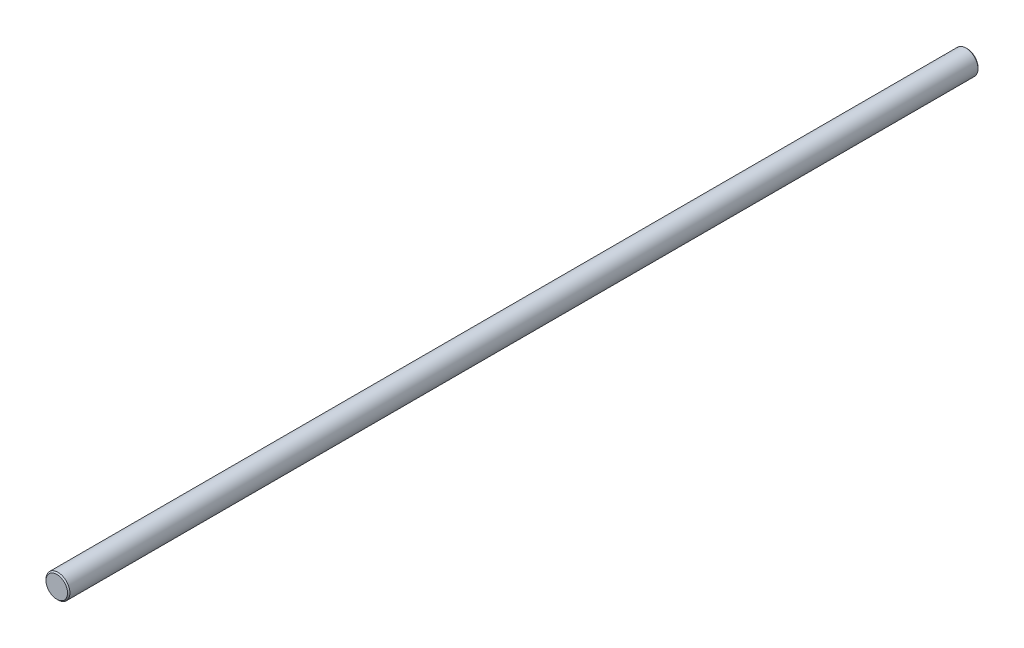
ISO-10303-21;
HEADER;
FILE_DESCRIPTION(('STEP AP214'),'2;1');
FILE_NAME('part.step','',(''),(''),'','','');
FILE_SCHEMA(('AUTOMOTIVE_DESIGN { 1 0 10303 214 1 1 1 1 }'));
ENDSEC;
DATA;
#1=APPLICATION_CONTEXT('core data for automotive mechanical design processes');
#2=APPLICATION_PROTOCOL_DEFINITION('international standard','automotive_design',2000,#1);
#3=PRODUCT_CONTEXT('',#1,'mechanical');
#4=PRODUCT('Part','Part','',(#3));
#5=PRODUCT_RELATED_PRODUCT_CATEGORY('part','',(#4));
#6=PRODUCT_DEFINITION_FORMATION('','',#4);
#7=PRODUCT_DEFINITION_CONTEXT('part definition',#1,'design');
#8=PRODUCT_DEFINITION('design','',#6,#7);
#9=PRODUCT_DEFINITION_SHAPE('','',#8);
#10=(LENGTH_UNIT() NAMED_UNIT(*) SI_UNIT(.MILLI.,.METRE.));
#11=(NAMED_UNIT(*) PLANE_ANGLE_UNIT() SI_UNIT($,.RADIAN.));
#12=(NAMED_UNIT(*) SI_UNIT($,.STERADIAN.) SOLID_ANGLE_UNIT());
#13=UNCERTAINTY_MEASURE_WITH_UNIT(LENGTH_MEASURE(1.E-05),#10,'distance_accuracy_value','');
#14=(GEOMETRIC_REPRESENTATION_CONTEXT(3) GLOBAL_UNCERTAINTY_ASSIGNED_CONTEXT((#13)) GLOBAL_UNIT_ASSIGNED_CONTEXT((#10,
#11,#12)) REPRESENTATION_CONTEXT('',''));
#15=CARTESIAN_POINT('',(0.,0.,0.));
#16=DIRECTION('',(0.,0.,1.));
#17=DIRECTION('',(1.,0.,0.));
#18=AXIS2_PLACEMENT_3D('',#15,#16,#17);
#19=CARTESIAN_POINT('',(0.,0.,-380.));
#20=DIRECTION('',(0.,0.,1.));
#21=DIRECTION('',(1.,0.,0.));
#22=AXIS2_PLACEMENT_3D('',#19,#20,#21);
#23=CYLINDRICAL_SURFACE('',#22,5.);
#24=CARTESIAN_POINT('',(0.,0.,-379.5));
#25=DIRECTION('',(0.,0.,1.));
#26=DIRECTION('',(1.,0.,0.));
#27=AXIS2_PLACEMENT_3D('',#24,#25,#26);
#28=CIRCLE('',#27,5.);
#29=CARTESIAN_POINT('',(5.,0.,-379.5));
#30=VERTEX_POINT('',#29);
#31=EDGE_CURVE('E48',#30,#30,#28,.T.);
#32=ORIENTED_EDGE('',*,*,#31,.T.);
#33=EDGE_LOOP('',(#32));
#34=FACE_BOUND('',#33,.T.);
#35=CARTESIAN_POINT('',(0.,0.,-0.5));
#36=DIRECTION('',(0.,0.,1.));
#37=DIRECTION('',(1.,0.,0.));
#38=AXIS2_PLACEMENT_3D('',#35,#36,#37);
#39=CIRCLE('',#38,5.);
#40=CARTESIAN_POINT('',(5.,0.,-0.5));
#41=VERTEX_POINT('',#40);
#42=EDGE_CURVE('E52',#41,#41,#39,.F.);
#43=ORIENTED_EDGE('',*,*,#42,.T.);
#44=EDGE_LOOP('',(#43));
#45=FACE_BOUND('',#44,.T.);
#46=ADVANCED_FACE('F37',(#34,#45),#23,.T.);
#47=CARTESIAN_POINT('',(0.,0.,-380.));
#48=DIRECTION('',(0.,0.,1.));
#49=DIRECTION('',(1.,0.,0.));
#50=AXIS2_PLACEMENT_3D('',#47,#48,#49);
#51=PLANE('',#50);
#52=CARTESIAN_POINT('',(0.,0.,-380.));
#53=DIRECTION('',(0.,0.,1.));
#54=DIRECTION('',(1.,0.,0.));
#55=AXIS2_PLACEMENT_3D('',#52,#53,#54);
#56=CIRCLE('',#55,4.50000000000006);
#57=CARTESIAN_POINT('',(4.50000000000006,0.,-380.));
#58=VERTEX_POINT('',#57);
#59=EDGE_CURVE('E44',#58,#58,#56,.F.);
#60=ORIENTED_EDGE('',*,*,#59,.T.);
#61=EDGE_LOOP('',(#60));
#62=FACE_BOUND('',#61,.T.);
#63=ADVANCED_FACE('F68',(#62),#51,.F.);
#64=CARTESIAN_POINT('',(0.,0.,0.));
#65=DIRECTION('',(0.,0.,1.));
#66=DIRECTION('',(1.,0.,0.));
#67=AXIS2_PLACEMENT_3D('',#64,#65,#66);
#68=PLANE('',#67);
#69=CARTESIAN_POINT('',(0.,0.,0.));
#70=DIRECTION('',(0.,0.,1.));
#71=DIRECTION('',(1.,0.,0.));
#72=AXIS2_PLACEMENT_3D('',#69,#70,#71);
#73=CIRCLE('',#72,4.5);
#74=CARTESIAN_POINT('',(4.5,0.,0.));
#75=VERTEX_POINT('',#74);
#76=EDGE_CURVE('E10',#75,#75,#73,.T.);
#77=ORIENTED_EDGE('',*,*,#76,.T.);
#78=EDGE_LOOP('',(#77));
#79=FACE_BOUND('',#78,.T.);
#80=ADVANCED_FACE('F65',(#79),#68,.T.);
#81=CARTESIAN_POINT('',(0.,0.,-379.5));
#82=DIRECTION('',(0.,0.,1.));
#83=DIRECTION('',(1.,0.,0.));
#84=AXIS2_PLACEMENT_3D('',#81,#82,#83);
#85=CONICAL_SURFACE('',#84,5.,0.785398163397444);
#86=ORIENTED_EDGE('',*,*,#59,.F.);
#87=EDGE_LOOP('',(#86));
#88=FACE_BOUND('',#87,.T.);
#89=ORIENTED_EDGE('',*,*,#31,.F.);
#90=EDGE_LOOP('',(#89));
#91=FACE_BOUND('',#90,.T.);
#92=ADVANCED_FACE('F61',(#88,#91),#85,.T.);
#93=CARTESIAN_POINT('',(0.,0.,0.));
#94=DIRECTION('',(0.,0.,-1.));
#95=DIRECTION('',(-1.,0.,0.));
#96=AXIS2_PLACEMENT_3D('',#93,#94,#95);
#97=CONICAL_SURFACE('',#96,4.5,0.785398163397444);
#98=ORIENTED_EDGE('',*,*,#42,.F.);
#99=EDGE_LOOP('',(#98));
#100=FACE_BOUND('',#99,.T.);
#101=ORIENTED_EDGE('',*,*,#76,.F.);
#102=EDGE_LOOP('',(#101));
#103=FACE_BOUND('',#102,.T.);
#104=ADVANCED_FACE('F39',(#100,#103),#97,.T.);
#105=CLOSED_SHELL('',(#46,#63,#80,#92,#104));
#106=MANIFOLD_SOLID_BREP('B2',#105);
#107=ADVANCED_BREP_SHAPE_REPRESENTATION('',(#18,#106),#14);
#108=SHAPE_DEFINITION_REPRESENTATION(#9,#107);
ENDSEC;
END-ISO-10303-21;
